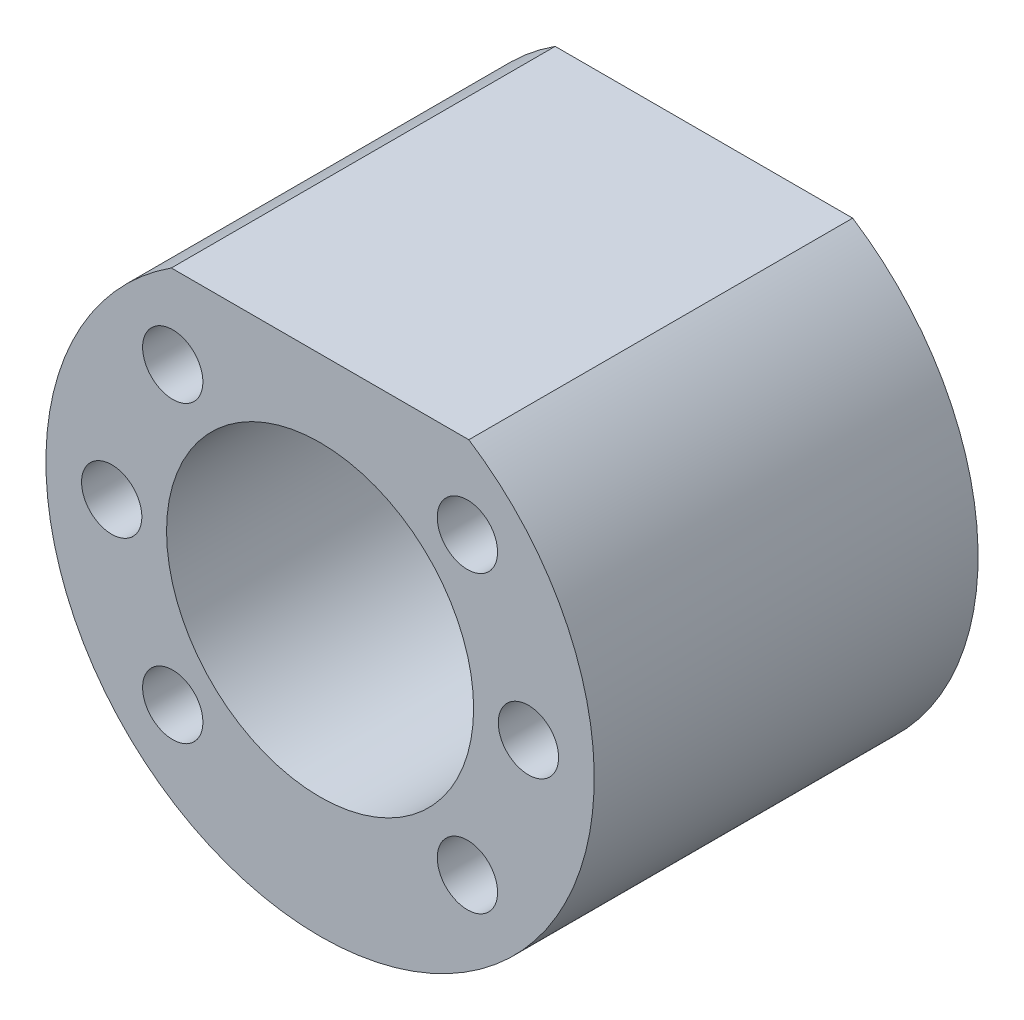
ISO-10303-21;
HEADER;
FILE_DESCRIPTION(('STEP AP214'),'2;1');
FILE_NAME('part.step','',(''),(''),'','','');
FILE_SCHEMA(('AUTOMOTIVE_DESIGN { 1 0 10303 214 1 1 1 1 }'));
ENDSEC;
DATA;
#1=APPLICATION_CONTEXT('core data for automotive mechanical design processes');
#2=APPLICATION_PROTOCOL_DEFINITION('international standard','automotive_design',2000,#1);
#3=PRODUCT_CONTEXT('',#1,'mechanical');
#4=PRODUCT('Part','Part','',(#3));
#5=PRODUCT_RELATED_PRODUCT_CATEGORY('part','',(#4));
#6=PRODUCT_DEFINITION_FORMATION('','',#4);
#7=PRODUCT_DEFINITION_CONTEXT('part definition',#1,'design');
#8=PRODUCT_DEFINITION('design','',#6,#7);
#9=PRODUCT_DEFINITION_SHAPE('','',#8);
#10=(LENGTH_UNIT() NAMED_UNIT(*) SI_UNIT(.MILLI.,.METRE.));
#11=(NAMED_UNIT(*) PLANE_ANGLE_UNIT() SI_UNIT($,.RADIAN.));
#12=(NAMED_UNIT(*) SI_UNIT($,.STERADIAN.) SOLID_ANGLE_UNIT());
#13=UNCERTAINTY_MEASURE_WITH_UNIT(LENGTH_MEASURE(1.E-05),#10,'distance_accuracy_value','');
#14=(GEOMETRIC_REPRESENTATION_CONTEXT(3) GLOBAL_UNCERTAINTY_ASSIGNED_CONTEXT((#13)) GLOBAL_UNIT_ASSIGNED_CONTEXT((#10,
#11,#12)) REPRESENTATION_CONTEXT('',''));
#15=CARTESIAN_POINT('',(0.,0.,0.));
#16=DIRECTION('',(0.,0.,1.));
#17=DIRECTION('',(1.,0.,0.));
#18=AXIS2_PLACEMENT_3D('',#15,#16,#17);
#19=CARTESIAN_POINT('',(0.,0.,35.));
#20=DIRECTION('',(0.,0.,1.));
#21=DIRECTION('',(1.,0.,0.));
#22=AXIS2_PLACEMENT_3D('',#19,#20,#21);
#23=PLANE('',#22);
#24=CARTESIAN_POINT('',(19.,0.,35.));
#25=DIRECTION('',(0.,0.,-1.));
#26=DIRECTION('',(-1.,0.,0.));
#27=AXIS2_PLACEMENT_3D('',#24,#25,#26);
#28=CIRCLE('',#27,2.75);
#29=CARTESIAN_POINT('',(16.25,0.,35.));
#30=VERTEX_POINT('',#29);
#31=EDGE_CURVE('E106',#30,#30,#28,.T.);
#32=ORIENTED_EDGE('',*,*,#31,.T.);
#33=EDGE_LOOP('',(#32));
#34=FACE_BOUND('',#33,.T.);
#35=CARTESIAN_POINT('',(0.,0.,35.));
#36=DIRECTION('',(0.,0.,1.));
#37=DIRECTION('',(1.,0.,0.));
#38=AXIS2_PLACEMENT_3D('',#35,#36,#37);
#39=CIRCLE('',#38,14.);
#40=CARTESIAN_POINT('',(14.,0.,35.));
#41=VERTEX_POINT('',#40);
#42=EDGE_CURVE('E78',#41,#41,#39,.T.);
#43=ORIENTED_EDGE('',*,*,#42,.F.);
#44=EDGE_LOOP('',(#43));
#45=FACE_BOUND('',#44,.T.);
#46=DIRECTION('',(1.,0.,0.));
#47=VECTOR('',#46,1.);
#48=CARTESIAN_POINT('',(-53.6904741439415,21.,35.));
#49=LINE('',#48,#47);
#50=CARTESIAN_POINT('',(-13.5646599662505,21.,35.));
#51=VERTEX_POINT('',#50);
#52=CARTESIAN_POINT('',(13.5646599662505,21.,35.));
#53=VERTEX_POINT('',#52);
#54=EDGE_CURVE('E48',#51,#53,#49,.T.);
#55=ORIENTED_EDGE('',*,*,#54,.F.);
#56=CARTESIAN_POINT('',(0.,0.,35.));
#57=DIRECTION('',(0.,0.,1.));
#58=DIRECTION('',(1.,0.,0.));
#59=AXIS2_PLACEMENT_3D('',#56,#57,#58);
#60=CIRCLE('',#59,25.);
#61=EDGE_CURVE('E11',#51,#53,#60,.T.);
#62=ORIENTED_EDGE('',*,*,#61,.T.);
#63=EDGE_LOOP('',(#55,#62));
#64=FACE_BOUND('',#63,.T.);
#65=CARTESIAN_POINT('',(-13.4350288425445,13.4350288425443,35.));
#66=DIRECTION('',(0.,0.,1.));
#67=DIRECTION('',(1.,0.,0.));
#68=AXIS2_PLACEMENT_3D('',#65,#66,#67);
#69=CIRCLE('',#68,2.75);
#70=CARTESIAN_POINT('',(-10.6850288425445,13.4350288425443,35.));
#71=VERTEX_POINT('',#70);
#72=EDGE_CURVE('E72',#71,#71,#69,.T.);
#73=ORIENTED_EDGE('',*,*,#72,.F.);
#74=EDGE_LOOP('',(#73));
#75=FACE_BOUND('',#74,.T.);
#76=CARTESIAN_POINT('',(-19.,0.,35.));
#77=DIRECTION('',(0.,0.,1.));
#78=DIRECTION('',(1.,0.,0.));
#79=AXIS2_PLACEMENT_3D('',#76,#77,#78);
#80=CIRCLE('',#79,2.75);
#81=CARTESIAN_POINT('',(-16.25,0.,35.));
#82=VERTEX_POINT('',#81);
#83=EDGE_CURVE('E129',#82,#82,#80,.T.);
#84=ORIENTED_EDGE('',*,*,#83,.F.);
#85=EDGE_LOOP('',(#84));
#86=FACE_BOUND('',#85,.T.);
#87=CARTESIAN_POINT('',(-13.4350288425443,-13.4350288425445,35.));
#88=DIRECTION('',(0.,0.,1.));
#89=DIRECTION('',(1.,0.,0.));
#90=AXIS2_PLACEMENT_3D('',#87,#88,#89);
#91=CIRCLE('',#90,2.75);
#92=CARTESIAN_POINT('',(-10.6850288425443,-13.4350288425445,35.));
#93=VERTEX_POINT('',#92);
#94=EDGE_CURVE('E123',#93,#93,#91,.T.);
#95=ORIENTED_EDGE('',*,*,#94,.F.);
#96=EDGE_LOOP('',(#95));
#97=FACE_BOUND('',#96,.T.);
#98=CARTESIAN_POINT('',(13.4350288425445,13.4350288425443,35.));
#99=DIRECTION('',(0.,0.,-1.));
#100=DIRECTION('',(-1.,0.,0.));
#101=AXIS2_PLACEMENT_3D('',#98,#99,#100);
#102=CIRCLE('',#101,2.75);
#103=CARTESIAN_POINT('',(10.6850288425445,13.4350288425443,35.));
#104=VERTEX_POINT('',#103);
#105=EDGE_CURVE('E113',#104,#104,#102,.T.);
#106=ORIENTED_EDGE('',*,*,#105,.T.);
#107=EDGE_LOOP('',(#106));
#108=FACE_BOUND('',#107,.T.);
#109=CARTESIAN_POINT('',(13.4350288425443,-13.4350288425445,35.));
#110=DIRECTION('',(0.,0.,-1.));
#111=DIRECTION('',(-1.,0.,0.));
#112=AXIS2_PLACEMENT_3D('',#109,#110,#111);
#113=CIRCLE('',#112,2.75);
#114=CARTESIAN_POINT('',(10.6850288425443,-13.4350288425445,35.));
#115=VERTEX_POINT('',#114);
#116=EDGE_CURVE('E116',#115,#115,#113,.T.);
#117=ORIENTED_EDGE('',*,*,#116,.T.);
#118=EDGE_LOOP('',(#117));
#119=FACE_BOUND('',#118,.T.);
#120=ADVANCED_FACE('F33',(#34,#45,#64,#75,#86,#97,#108,#119),#23,.T.);
#121=CARTESIAN_POINT('',(0.,0.,0.));
#122=DIRECTION('',(0.,0.,1.));
#123=DIRECTION('',(1.,0.,0.));
#124=AXIS2_PLACEMENT_3D('',#121,#122,#123);
#125=PLANE('',#124);
#126=CARTESIAN_POINT('',(0.,0.,0.));
#127=DIRECTION('',(0.,0.,1.));
#128=DIRECTION('',(1.,0.,0.));
#129=AXIS2_PLACEMENT_3D('',#126,#127,#128);
#130=CIRCLE('',#129,25.);
#131=CARTESIAN_POINT('',(-13.5646599662505,21.,0.));
#132=VERTEX_POINT('',#131);
#133=CARTESIAN_POINT('',(13.5646599662505,21.,0.));
#134=VERTEX_POINT('',#133);
#135=EDGE_CURVE('E37',#132,#134,#130,.T.);
#136=ORIENTED_EDGE('',*,*,#135,.F.);
#137=DIRECTION('',(-1.,0.,0.));
#138=VECTOR('',#137,1.);
#139=CARTESIAN_POINT('',(-53.6904741439415,21.,0.));
#140=LINE('',#139,#138);
#141=EDGE_CURVE('E53',#134,#132,#140,.T.);
#142=ORIENTED_EDGE('',*,*,#141,.F.);
#143=EDGE_LOOP('',(#136,#142));
#144=FACE_BOUND('',#143,.T.);
#145=CARTESIAN_POINT('',(0.,0.,0.));
#146=DIRECTION('',(0.,0.,1.));
#147=DIRECTION('',(1.,0.,0.));
#148=AXIS2_PLACEMENT_3D('',#145,#146,#147);
#149=CIRCLE('',#148,14.);
#150=CARTESIAN_POINT('',(14.,0.,0.));
#151=VERTEX_POINT('',#150);
#152=EDGE_CURVE('E77',#151,#151,#149,.T.);
#153=ORIENTED_EDGE('',*,*,#152,.T.);
#154=EDGE_LOOP('',(#153));
#155=FACE_BOUND('',#154,.T.);
#156=ADVANCED_FACE('F84',(#144,#155),#125,.F.);
#157=CARTESIAN_POINT('',(0.,0.,35.));
#158=DIRECTION('',(0.,0.,-1.));
#159=DIRECTION('',(-1.,0.,0.));
#160=AXIS2_PLACEMENT_3D('',#157,#158,#159);
#161=CYLINDRICAL_SURFACE('',#160,25.);
#162=ORIENTED_EDGE('',*,*,#61,.F.);
#163=DIRECTION('',(0.,0.,-1.));
#164=VECTOR('',#163,1.);
#165=CARTESIAN_POINT('',(-13.5646599662505,21.,35.));
#166=LINE('',#165,#164);
#167=EDGE_CURVE('E58',#132,#51,#166,.F.);
#168=ORIENTED_EDGE('',*,*,#167,.F.);
#169=ORIENTED_EDGE('',*,*,#135,.T.);
#170=DIRECTION('',(0.,0.,-1.));
#171=VECTOR('',#170,1.);
#172=CARTESIAN_POINT('',(13.5646599662505,21.,35.));
#173=LINE('',#172,#171);
#174=EDGE_CURVE('E64',#53,#134,#173,.T.);
#175=ORIENTED_EDGE('',*,*,#174,.F.);
#176=EDGE_LOOP('',(#162,#168,#169,#175));
#177=FACE_BOUND('',#176,.T.);
#178=ADVANCED_FACE('F35',(#177),#161,.T.);
#179=CARTESIAN_POINT('',(0.,0.,35.));
#180=DIRECTION('',(0.,0.,-1.));
#181=DIRECTION('',(-1.,0.,0.));
#182=AXIS2_PLACEMENT_3D('',#179,#180,#181);
#183=CYLINDRICAL_SURFACE('',#182,14.);
#184=ORIENTED_EDGE('',*,*,#42,.T.);
#185=EDGE_LOOP('',(#184));
#186=FACE_BOUND('',#185,.T.);
#187=ORIENTED_EDGE('',*,*,#152,.F.);
#188=EDGE_LOOP('',(#187));
#189=FACE_BOUND('',#188,.T.);
#190=ADVANCED_FACE('F86',(#186,#189),#183,.F.);
#191=CARTESIAN_POINT('',(-53.6904741439415,21.,-0.001000000000001));
#192=DIRECTION('',(0.,-1.,0.));
#193=DIRECTION('',(0.,0.,-1.));
#194=AXIS2_PLACEMENT_3D('',#191,#192,#193);
#195=PLANE('',#194);
#196=ORIENTED_EDGE('',*,*,#167,.T.);
#197=ORIENTED_EDGE('',*,*,#54,.T.);
#198=ORIENTED_EDGE('',*,*,#174,.T.);
#199=ORIENTED_EDGE('',*,*,#141,.T.);
#200=EDGE_LOOP('',(#196,#197,#198,#199));
#201=FACE_BOUND('',#200,.T.);
#202=ADVANCED_FACE('F59',(#201),#195,.F.);
#203=CARTESIAN_POINT('',(-13.4350288425445,13.4350288425443,19.));
#204=DIRECTION('',(0.,0.,1.));
#205=DIRECTION('',(1.,0.,0.));
#206=AXIS2_PLACEMENT_3D('',#203,#204,#205);
#207=CYLINDRICAL_SURFACE('',#206,2.75);
#208=CARTESIAN_POINT('',(-13.4350288425445,13.4350288425443,19.));
#209=DIRECTION('',(0.,0.,1.));
#210=DIRECTION('',(1.,0.,0.));
#211=AXIS2_PLACEMENT_3D('',#208,#209,#210);
#212=CIRCLE('',#211,2.75);
#213=CARTESIAN_POINT('',(-10.6850288425445,13.4350288425443,19.));
#214=VERTEX_POINT('',#213);
#215=EDGE_CURVE('E69',#214,#214,#212,.T.);
#216=ORIENTED_EDGE('',*,*,#215,.F.);
#217=EDGE_LOOP('',(#216));
#218=FACE_BOUND('',#217,.T.);
#219=ORIENTED_EDGE('',*,*,#72,.T.);
#220=EDGE_LOOP('',(#219));
#221=FACE_BOUND('',#220,.T.);
#222=ADVANCED_FACE('F94',(#218,#221),#207,.F.);
#223=CARTESIAN_POINT('',(-13.4350288425445,13.4350288425443,19.));
#224=DIRECTION('',(0.,0.,1.));
#225=DIRECTION('',(1.,0.,0.));
#226=AXIS2_PLACEMENT_3D('',#223,#224,#225);
#227=PLANE('',#226);
#228=ORIENTED_EDGE('',*,*,#215,.T.);
#229=EDGE_LOOP('',(#228));
#230=FACE_BOUND('',#229,.T.);
#231=ADVANCED_FACE('F189',(#230),#227,.T.);
#232=CARTESIAN_POINT('',(-19.,0.,19.));
#233=DIRECTION('',(0.,0.,1.));
#234=DIRECTION('',(1.,0.,0.));
#235=AXIS2_PLACEMENT_3D('',#232,#233,#234);
#236=CYLINDRICAL_SURFACE('',#235,2.75);
#237=CARTESIAN_POINT('',(-19.,0.,19.));
#238=DIRECTION('',(0.,0.,1.));
#239=DIRECTION('',(1.,0.,0.));
#240=AXIS2_PLACEMENT_3D('',#237,#238,#239);
#241=CIRCLE('',#240,2.75);
#242=CARTESIAN_POINT('',(-16.25,0.,19.));
#243=VERTEX_POINT('',#242);
#244=EDGE_CURVE('E132',#243,#243,#241,.T.);
#245=ORIENTED_EDGE('',*,*,#244,.F.);
#246=EDGE_LOOP('',(#245));
#247=FACE_BOUND('',#246,.T.);
#248=ORIENTED_EDGE('',*,*,#83,.T.);
#249=EDGE_LOOP('',(#248));
#250=FACE_BOUND('',#249,.T.);
#251=ADVANCED_FACE('F138',(#247,#250),#236,.F.);
#252=CARTESIAN_POINT('',(-19.,0.,19.));
#253=DIRECTION('',(0.,0.,1.));
#254=DIRECTION('',(1.,0.,0.));
#255=AXIS2_PLACEMENT_3D('',#252,#253,#254);
#256=PLANE('',#255);
#257=ORIENTED_EDGE('',*,*,#244,.T.);
#258=EDGE_LOOP('',(#257));
#259=FACE_BOUND('',#258,.T.);
#260=ADVANCED_FACE('F182',(#259),#256,.T.);
#261=CARTESIAN_POINT('',(-13.4350288425443,-13.4350288425445,19.));
#262=DIRECTION('',(0.,0.,1.));
#263=DIRECTION('',(1.,0.,0.));
#264=AXIS2_PLACEMENT_3D('',#261,#262,#263);
#265=CYLINDRICAL_SURFACE('',#264,2.75);
#266=CARTESIAN_POINT('',(-13.4350288425443,-13.4350288425445,19.));
#267=DIRECTION('',(0.,0.,1.));
#268=DIRECTION('',(1.,0.,0.));
#269=AXIS2_PLACEMENT_3D('',#266,#267,#268);
#270=CIRCLE('',#269,2.75);
#271=CARTESIAN_POINT('',(-10.6850288425443,-13.4350288425445,19.));
#272=VERTEX_POINT('',#271);
#273=EDGE_CURVE('E126',#272,#272,#270,.T.);
#274=ORIENTED_EDGE('',*,*,#273,.F.);
#275=EDGE_LOOP('',(#274));
#276=FACE_BOUND('',#275,.T.);
#277=ORIENTED_EDGE('',*,*,#94,.T.);
#278=EDGE_LOOP('',(#277));
#279=FACE_BOUND('',#278,.T.);
#280=ADVANCED_FACE('F178',(#276,#279),#265,.F.);
#281=CARTESIAN_POINT('',(-13.4350288425443,-13.4350288425445,19.));
#282=DIRECTION('',(0.,0.,1.));
#283=DIRECTION('',(1.,0.,0.));
#284=AXIS2_PLACEMENT_3D('',#281,#282,#283);
#285=PLANE('',#284);
#286=ORIENTED_EDGE('',*,*,#273,.T.);
#287=EDGE_LOOP('',(#286));
#288=FACE_BOUND('',#287,.T.);
#289=ADVANCED_FACE('F174',(#288),#285,.T.);
#290=CARTESIAN_POINT('',(13.4350288425445,13.4350288425443,19.));
#291=DIRECTION('',(0.,0.,1.));
#292=DIRECTION('',(1.,0.,0.));
#293=AXIS2_PLACEMENT_3D('',#290,#291,#292);
#294=CYLINDRICAL_SURFACE('',#293,2.75);
#295=CARTESIAN_POINT('',(13.4350288425445,13.4350288425443,19.));
#296=DIRECTION('',(0.,0.,-1.));
#297=DIRECTION('',(-1.,0.,0.));
#298=AXIS2_PLACEMENT_3D('',#295,#296,#297);
#299=CIRCLE('',#298,2.75);
#300=CARTESIAN_POINT('',(10.6850288425445,13.4350288425443,19.));
#301=VERTEX_POINT('',#300);
#302=EDGE_CURVE('E120',#301,#301,#299,.T.);
#303=ORIENTED_EDGE('',*,*,#302,.T.);
#304=EDGE_LOOP('',(#303));
#305=FACE_BOUND('',#304,.T.);
#306=ORIENTED_EDGE('',*,*,#105,.F.);
#307=EDGE_LOOP('',(#306));
#308=FACE_BOUND('',#307,.T.);
#309=ADVANCED_FACE('F170',(#305,#308),#294,.F.);
#310=CARTESIAN_POINT('',(13.4350288425445,13.4350288425443,19.));
#311=DIRECTION('',(0.,0.,1.));
#312=DIRECTION('',(-1.,0.,0.));
#313=AXIS2_PLACEMENT_3D('',#310,#311,#312);
#314=PLANE('',#313);
#315=ORIENTED_EDGE('',*,*,#302,.F.);
#316=EDGE_LOOP('',(#315));
#317=FACE_BOUND('',#316,.T.);
#318=ADVANCED_FACE('F166',(#317),#314,.T.);
#319=CARTESIAN_POINT('',(19.,0.,19.));
#320=DIRECTION('',(0.,0.,1.));
#321=DIRECTION('',(1.,0.,0.));
#322=AXIS2_PLACEMENT_3D('',#319,#320,#321);
#323=CYLINDRICAL_SURFACE('',#322,2.75);
#324=CARTESIAN_POINT('',(19.,0.,19.));
#325=DIRECTION('',(0.,0.,-1.));
#326=DIRECTION('',(-1.,0.,0.));
#327=AXIS2_PLACEMENT_3D('',#324,#325,#326);
#328=CIRCLE('',#327,2.75);
#329=CARTESIAN_POINT('',(16.25,0.,19.));
#330=VERTEX_POINT('',#329);
#331=EDGE_CURVE('E109',#330,#330,#328,.T.);
#332=ORIENTED_EDGE('',*,*,#331,.T.);
#333=EDGE_LOOP('',(#332));
#334=FACE_BOUND('',#333,.T.);
#335=ORIENTED_EDGE('',*,*,#31,.F.);
#336=EDGE_LOOP('',(#335));
#337=FACE_BOUND('',#336,.T.);
#338=ADVANCED_FACE('F160',(#334,#337),#323,.F.);
#339=CARTESIAN_POINT('',(19.,0.,19.));
#340=DIRECTION('',(0.,0.,1.));
#341=DIRECTION('',(-1.,0.,0.));
#342=AXIS2_PLACEMENT_3D('',#339,#340,#341);
#343=PLANE('',#342);
#344=ORIENTED_EDGE('',*,*,#331,.F.);
#345=EDGE_LOOP('',(#344));
#346=FACE_BOUND('',#345,.T.);
#347=ADVANCED_FACE('F151',(#346),#343,.T.);
#348=CARTESIAN_POINT('',(13.4350288425443,-13.4350288425445,19.));
#349=DIRECTION('',(0.,0.,1.));
#350=DIRECTION('',(1.,0.,0.));
#351=AXIS2_PLACEMENT_3D('',#348,#349,#350);
#352=CYLINDRICAL_SURFACE('',#351,2.75);
#353=CARTESIAN_POINT('',(13.4350288425443,-13.4350288425445,19.));
#354=DIRECTION('',(0.,0.,-1.));
#355=DIRECTION('',(-1.,0.,0.));
#356=AXIS2_PLACEMENT_3D('',#353,#354,#355);
#357=CIRCLE('',#356,2.75);
#358=CARTESIAN_POINT('',(10.6850288425443,-13.4350288425445,19.));
#359=VERTEX_POINT('',#358);
#360=EDGE_CURVE('E110',#359,#359,#357,.T.);
#361=ORIENTED_EDGE('',*,*,#360,.T.);
#362=EDGE_LOOP('',(#361));
#363=FACE_BOUND('',#362,.T.);
#364=ORIENTED_EDGE('',*,*,#116,.F.);
#365=EDGE_LOOP('',(#364));
#366=FACE_BOUND('',#365,.T.);
#367=ADVANCED_FACE('F148',(#363,#366),#352,.F.);
#368=CARTESIAN_POINT('',(13.4350288425443,-13.4350288425445,19.));
#369=DIRECTION('',(0.,0.,1.));
#370=DIRECTION('',(-1.,0.,0.));
#371=AXIS2_PLACEMENT_3D('',#368,#369,#370);
#372=PLANE('',#371);
#373=ORIENTED_EDGE('',*,*,#360,.F.);
#374=EDGE_LOOP('',(#373));
#375=FACE_BOUND('',#374,.T.);
#376=ADVANCED_FACE('F150',(#375),#372,.T.);
#377=CLOSED_SHELL('',(#120,#156,#178,#190,#202,#222,#231,#251,#260,#280,#289,#309,#318,#338,
#347,#367,#376));
#378=MANIFOLD_SOLID_BREP('B2',#377);
#379=ADVANCED_BREP_SHAPE_REPRESENTATION('',(#18,#378),#14);
#380=SHAPE_DEFINITION_REPRESENTATION(#9,#379);
ENDSEC;
END-ISO-10303-21;
